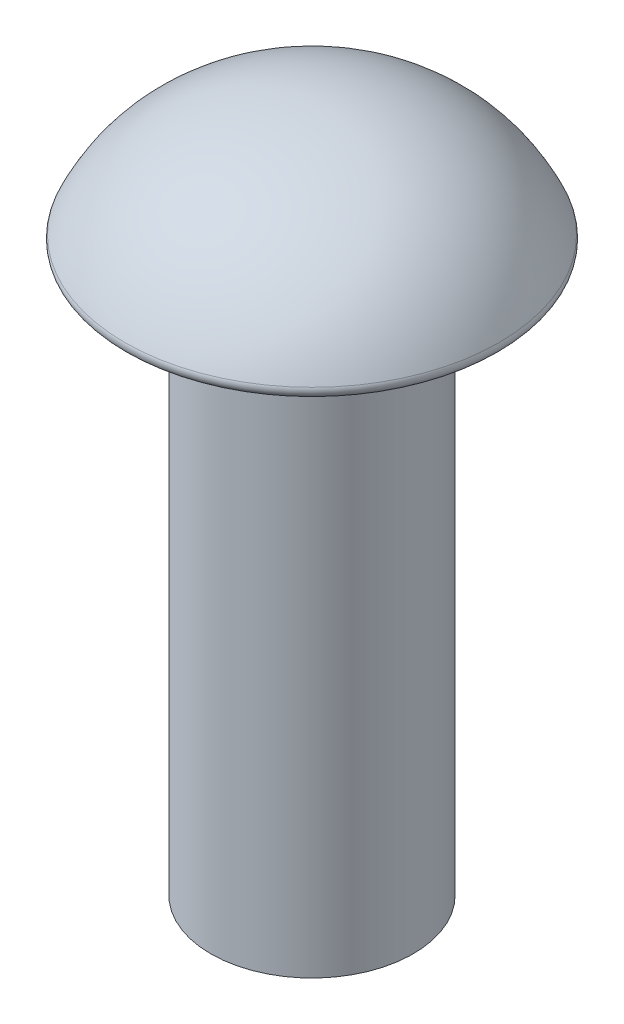
ISO-10303-21;
HEADER;
FILE_DESCRIPTION(('STEP AP214'),'2;1');
FILE_NAME('part.step','',(''),(''),'','','');
FILE_SCHEMA(('AUTOMOTIVE_DESIGN { 1 0 10303 214 1 1 1 1 }'));
ENDSEC;
DATA;
#1=APPLICATION_CONTEXT('core data for automotive mechanical design processes');
#2=APPLICATION_PROTOCOL_DEFINITION('international standard','automotive_design',2000,#1);
#3=PRODUCT_CONTEXT('',#1,'mechanical');
#4=PRODUCT('Part','Part','',(#3));
#5=PRODUCT_RELATED_PRODUCT_CATEGORY('part','',(#4));
#6=PRODUCT_DEFINITION_FORMATION('','',#4);
#7=PRODUCT_DEFINITION_CONTEXT('part definition',#1,'design');
#8=PRODUCT_DEFINITION('design','',#6,#7);
#9=PRODUCT_DEFINITION_SHAPE('','',#8);
#10=(LENGTH_UNIT() NAMED_UNIT(*) SI_UNIT(.MILLI.,.METRE.));
#11=(NAMED_UNIT(*) PLANE_ANGLE_UNIT() SI_UNIT($,.RADIAN.));
#12=(NAMED_UNIT(*) SI_UNIT($,.STERADIAN.) SOLID_ANGLE_UNIT());
#13=UNCERTAINTY_MEASURE_WITH_UNIT(LENGTH_MEASURE(1.E-05),#10,'distance_accuracy_value','');
#14=(GEOMETRIC_REPRESENTATION_CONTEXT(3) GLOBAL_UNCERTAINTY_ASSIGNED_CONTEXT((#13)) GLOBAL_UNIT_ASSIGNED_CONTEXT((#10,
#11,#12)) REPRESENTATION_CONTEXT('',''));
#15=CARTESIAN_POINT('',(0.,0.,0.));
#16=DIRECTION('',(0.,0.,1.));
#17=DIRECTION('',(1.,0.,0.));
#18=AXIS2_PLACEMENT_3D('',#15,#16,#17);
#19=CARTESIAN_POINT('',(0.,13.3,0.));
#20=DIRECTION('',(0.,-1.,0.));
#21=DIRECTION('',(0.,0.,-1.));
#22=AXIS2_PLACEMENT_3D('',#19,#20,#21);
#23=CYLINDRICAL_SURFACE('',#22,2.4);
#24=CARTESIAN_POINT('',(0.,13.3,0.));
#25=DIRECTION('',(0.,1.,0.));
#26=DIRECTION('',(0.,0.,1.));
#27=AXIS2_PLACEMENT_3D('',#24,#25,#26);
#28=CIRCLE('',#27,2.4);
#29=CARTESIAN_POINT('',(0.,13.3,2.4));
#30=VERTEX_POINT('',#29);
#31=EDGE_CURVE('E80',#30,#30,#28,.T.);
#32=ORIENTED_EDGE('',*,*,#31,.F.);
#33=EDGE_LOOP('',(#32));
#34=FACE_BOUND('',#33,.T.);
#35=CARTESIAN_POINT('',(0.,0.,0.));
#36=DIRECTION('',(0.,1.,0.));
#37=DIRECTION('',(0.,0.,1.));
#38=AXIS2_PLACEMENT_3D('',#35,#36,#37);
#39=CIRCLE('',#38,2.4);
#40=CARTESIAN_POINT('',(0.,0.,2.4));
#41=VERTEX_POINT('',#40);
#42=EDGE_CURVE('E83',#41,#41,#39,.T.);
#43=ORIENTED_EDGE('',*,*,#42,.T.);
#44=EDGE_LOOP('',(#43));
#45=FACE_BOUND('',#44,.T.);
#46=ADVANCED_FACE('F45',(#34,#45),#23,.T.);
#47=CARTESIAN_POINT('',(0.,0.,0.));
#48=DIRECTION('',(0.,1.,0.));
#49=DIRECTION('',(0.,0.,1.));
#50=AXIS2_PLACEMENT_3D('',#47,#48,#49);
#51=PLANE('',#50);
#52=ORIENTED_EDGE('',*,*,#42,.F.);
#53=EDGE_LOOP('',(#52));
#54=FACE_BOUND('',#53,.T.);
#55=ADVANCED_FACE('F66',(#54),#51,.F.);
#56=CARTESIAN_POINT('',(-4.55,13.3,0.));
#57=DIRECTION('',(0.,1.,0.));
#58=DIRECTION('',(0.,0.,1.));
#59=AXIS2_PLACEMENT_3D('',#56,#57,#58);
#60=PLANE('',#59);
#61=CARTESIAN_POINT('',(0.,13.3,0.));
#62=DIRECTION('',(0.,1.,0.));
#63=DIRECTION('',(0.,0.,1.));
#64=AXIS2_PLACEMENT_3D('',#61,#62,#63);
#65=CIRCLE('',#64,4.26258841686343);
#66=CARTESIAN_POINT('',(0.,13.3,4.26258841686343));
#67=VERTEX_POINT('',#66);
#68=EDGE_CURVE('E53',#67,#67,#65,.F.);
#69=ORIENTED_EDGE('',*,*,#68,.T.);
#70=EDGE_LOOP('',(#69));
#71=FACE_BOUND('',#70,.T.);
#72=ORIENTED_EDGE('',*,*,#31,.T.);
#73=EDGE_LOOP('',(#72));
#74=FACE_BOUND('',#73,.T.);
#75=ADVANCED_FACE('F58',(#71,#74),#60,.F.);
#76=CARTESIAN_POINT('',(0.,16.2,0.));
#77=CARTESIAN_POINT('',(-1.79853335310253,16.2,0.));
#78=CARTESIAN_POINT('',(-3.7165386927133,15.4372531479008,0.));
#79=CARTESIAN_POINT('',(-4.55,13.3,0.));
#80=B_SPLINE_CURVE_WITH_KNOTS('',3,(#76,#77,#78,#79),.UNSPECIFIED.,.F.,.F.,(4,4),(0.,1.),.UNSPECIFIED.);
#81=CARTESIAN_POINT('',(0.,13.3,0.));
#82=DIRECTION('',(0.,-1.,0.));
#83=AXIS1_PLACEMENT('',#81,#82);
#84=SURFACE_OF_REVOLUTION('',#80,#83);
#85=CARTESIAN_POINT('',(0.,13.5698388795566,0.));
#86=DIRECTION('',(0.,-1.,0.));
#87=DIRECTION('',(0.,0.,-1.));
#88=AXIS2_PLACEMENT_3D('',#85,#86,#87);
#89=CIRCLE('',#88,4.4357807729035);
#90=CARTESIAN_POINT('',(0.,13.5698388795566,-4.4357807729035));
#91=VERTEX_POINT('',#90);
#92=EDGE_CURVE('E11',#91,#91,#89,.F.);
#93=ORIENTED_EDGE('',*,*,#92,.T.);
#94=EDGE_LOOP('',(#93));
#95=FACE_BOUND('',#94,.T.);
#96=CARTESIAN_POINT('',(0.,16.2,0.));
#97=VERTEX_POINT('',#96);
#98=VERTEX_LOOP('',#97);
#99=FACE_BOUND('',#98,.T.);
#100=ADVANCED_FACE('F56',(#95,#99),#84,.T.);
#101=CARTESIAN_POINT('',(0.,13.4905,0.));
#102=DIRECTION('',(0.,-1.,0.));
#103=DIRECTION('',(0.,0.,-1.));
#104=AXIS2_PLACEMENT_3D('',#101,#102,#103);
#105=TOROIDAL_SURFACE('',#104,4.26258841686343,0.1905);
#106=ORIENTED_EDGE('',*,*,#92,.F.);
#107=EDGE_LOOP('',(#106));
#108=FACE_BOUND('',#107,.T.);
#109=ORIENTED_EDGE('',*,*,#68,.F.);
#110=EDGE_LOOP('',(#109));
#111=FACE_BOUND('',#110,.T.);
#112=ADVANCED_FACE('F47',(#108,#111),#105,.T.);
#113=CLOSED_SHELL('',(#46,#55,#75,#100,#112));
#114=MANIFOLD_SOLID_BREP('B2',#113);
#115=ADVANCED_BREP_SHAPE_REPRESENTATION('',(#18,#114),#14);
#116=SHAPE_DEFINITION_REPRESENTATION(#9,#115);
ENDSEC;
END-ISO-10303-21;
